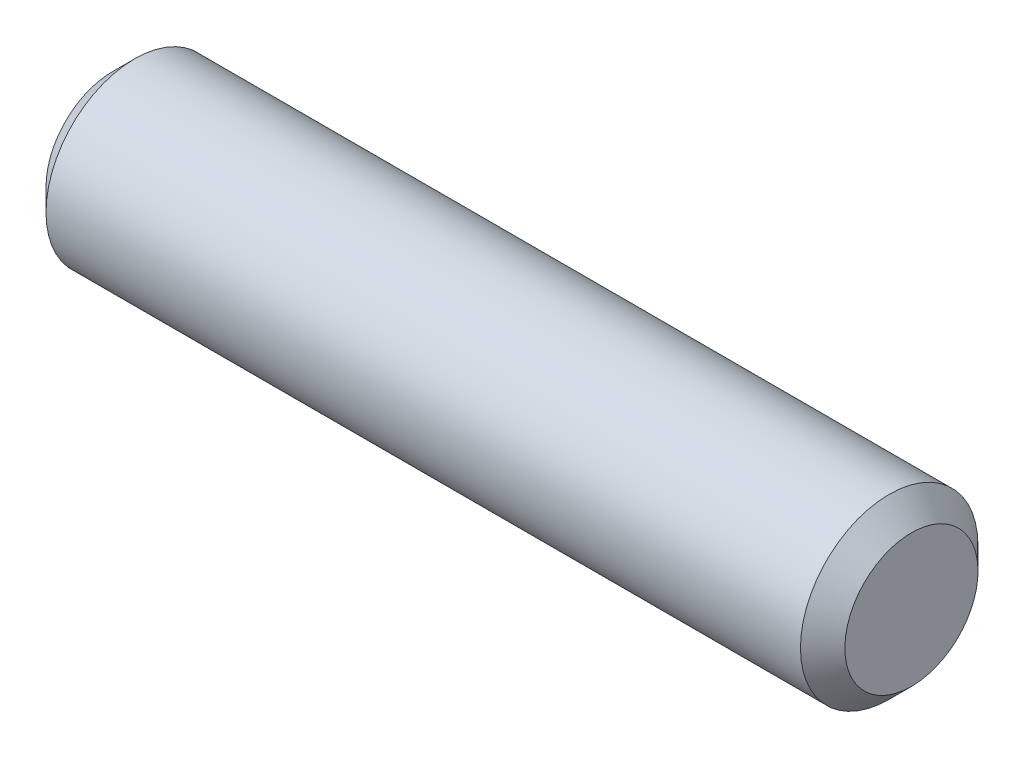
ISO-10303-21;
HEADER;
FILE_DESCRIPTION(('STEP AP214'),'2;1');
FILE_NAME('part.step','',(''),(''),'','','');
FILE_SCHEMA(('AUTOMOTIVE_DESIGN { 1 0 10303 214 1 1 1 1 }'));
ENDSEC;
DATA;
#1=APPLICATION_CONTEXT('core data for automotive mechanical design processes');
#2=APPLICATION_PROTOCOL_DEFINITION('international standard','automotive_design',2000,#1);
#3=PRODUCT_CONTEXT('',#1,'mechanical');
#4=PRODUCT('Part','Part','',(#3));
#5=PRODUCT_RELATED_PRODUCT_CATEGORY('part','',(#4));
#6=PRODUCT_DEFINITION_FORMATION('','',#4);
#7=PRODUCT_DEFINITION_CONTEXT('part definition',#1,'design');
#8=PRODUCT_DEFINITION('design','',#6,#7);
#9=PRODUCT_DEFINITION_SHAPE('','',#8);
#10=(LENGTH_UNIT() NAMED_UNIT(*) SI_UNIT(.MILLI.,.METRE.));
#11=(NAMED_UNIT(*) PLANE_ANGLE_UNIT() SI_UNIT($,.RADIAN.));
#12=(NAMED_UNIT(*) SI_UNIT($,.STERADIAN.) SOLID_ANGLE_UNIT());
#13=UNCERTAINTY_MEASURE_WITH_UNIT(LENGTH_MEASURE(1.E-05),#10,'distance_accuracy_value','');
#14=(GEOMETRIC_REPRESENTATION_CONTEXT(3) GLOBAL_UNCERTAINTY_ASSIGNED_CONTEXT((#13)) GLOBAL_UNIT_ASSIGNED_CONTEXT((#10,
#11,#12)) REPRESENTATION_CONTEXT('',''));
#15=CARTESIAN_POINT('',(0.,0.,0.));
#16=DIRECTION('',(0.,0.,1.));
#17=DIRECTION('',(1.,0.,0.));
#18=AXIS2_PLACEMENT_3D('',#15,#16,#17);
#19=CARTESIAN_POINT('',(14.2875,0.,0.));
#20=DIRECTION('',(1.,0.,0.));
#21=DIRECTION('',(0.,0.,1.));
#22=AXIS2_PLACEMENT_3D('',#19,#20,#21);
#23=PLANE('',#22);
#24=CARTESIAN_POINT('',(14.2875000000231,0.,0.));
#25=DIRECTION('',(1.,0.,0.));
#26=DIRECTION('',(0.,-1.,0.));
#27=AXIS2_PLACEMENT_3D('',#24,#25,#26);
#28=CIRCLE('',#27,2.3812499999849);
#29=CARTESIAN_POINT('',(14.2875000000231,-2.3812499999849,0.));
#30=VERTEX_POINT('',#29);
#31=EDGE_CURVE('E38',#30,#30,#28,.T.);
#32=ORIENTED_EDGE('',*,*,#31,.T.);
#33=EDGE_LOOP('',(#32));
#34=FACE_BOUND('',#33,.T.);
#35=ADVANCED_FACE('F35',(#34),#23,.T.);
#36=CARTESIAN_POINT('',(-14.2875,0.,0.));
#37=DIRECTION('',(1.,0.,0.));
#38=DIRECTION('',(0.,0.,1.));
#39=AXIS2_PLACEMENT_3D('',#36,#37,#38);
#40=PLANE('',#39);
#41=CARTESIAN_POINT('',(-14.2874999999663,0.,0.));
#42=DIRECTION('',(-1.,0.,0.));
#43=DIRECTION('',(0.,0.,1.));
#44=AXIS2_PLACEMENT_3D('',#41,#42,#43);
#45=CIRCLE('',#44,2.38125000004175);
#46=CARTESIAN_POINT('',(-14.2874999999663,0.,2.38125000004175));
#47=VERTEX_POINT('',#46);
#48=EDGE_CURVE('E47',#47,#47,#45,.T.);
#49=ORIENTED_EDGE('',*,*,#48,.T.);
#50=EDGE_LOOP('',(#49));
#51=FACE_BOUND('',#50,.T.);
#52=ADVANCED_FACE('F59',(#51),#40,.F.);
#53=CARTESIAN_POINT('',(13.493750000066,0.,0.));
#54=DIRECTION('',(-1.,0.,0.));
#55=DIRECTION('',(0.,-1.,0.));
#56=AXIS2_PLACEMENT_3D('',#53,#54,#55);
#57=CONICAL_SURFACE('',#56,3.17499999994197,0.785398163397448);
#58=CARTESIAN_POINT('',(13.49375,0.,0.));
#59=DIRECTION('',(1.,0.,0.));
#60=DIRECTION('',(0.,0.,-1.));
#61=AXIS2_PLACEMENT_3D('',#58,#59,#60);
#62=CIRCLE('',#61,3.175);
#63=CARTESIAN_POINT('',(13.49375,0.,-3.175));
#64=VERTEX_POINT('',#63);
#65=EDGE_CURVE('E42',#64,#64,#62,.T.);
#66=ORIENTED_EDGE('',*,*,#65,.T.);
#67=EDGE_LOOP('',(#66));
#68=FACE_BOUND('',#67,.T.);
#69=ORIENTED_EDGE('',*,*,#31,.F.);
#70=EDGE_LOOP('',(#69));
#71=FACE_BOUND('',#70,.T.);
#72=ADVANCED_FACE('F56',(#68,#71),#57,.T.);
#73=CARTESIAN_POINT('',(-13.4937500000092,0.,0.));
#74=DIRECTION('',(1.,0.,0.));
#75=DIRECTION('',(0.,0.,1.));
#76=AXIS2_PLACEMENT_3D('',#73,#74,#75);
#77=CONICAL_SURFACE('',#76,3.17499999994197,0.785398163361641);
#78=CARTESIAN_POINT('',(-13.49375,0.,0.));
#79=DIRECTION('',(1.,0.,0.));
#80=DIRECTION('',(0.,0.,-1.));
#81=AXIS2_PLACEMENT_3D('',#78,#79,#80);
#82=CIRCLE('',#81,3.175);
#83=CARTESIAN_POINT('',(-13.49375,0.,-3.175));
#84=VERTEX_POINT('',#83);
#85=EDGE_CURVE('E10',#84,#84,#82,.F.);
#86=ORIENTED_EDGE('',*,*,#85,.T.);
#87=EDGE_LOOP('',(#86));
#88=FACE_BOUND('',#87,.T.);
#89=ORIENTED_EDGE('',*,*,#48,.F.);
#90=EDGE_LOOP('',(#89));
#91=FACE_BOUND('',#90,.T.);
#92=ADVANCED_FACE('F58',(#88,#91),#77,.T.);
#93=CARTESIAN_POINT('',(14.2875,0.,0.));
#94=DIRECTION('',(-1.,0.,0.));
#95=DIRECTION('',(0.,0.,-1.));
#96=AXIS2_PLACEMENT_3D('',#93,#94,#95);
#97=CYLINDRICAL_SURFACE('',#96,3.175);
#98=ORIENTED_EDGE('',*,*,#85,.F.);
#99=EDGE_LOOP('',(#98));
#100=FACE_BOUND('',#99,.T.);
#101=ORIENTED_EDGE('',*,*,#65,.F.);
#102=EDGE_LOOP('',(#101));
#103=FACE_BOUND('',#102,.T.);
#104=ADVANCED_FACE('F66',(#100,#103),#97,.T.);
#105=CLOSED_SHELL('',(#35,#52,#72,#92,#104));
#106=MANIFOLD_SOLID_BREP('B2',#105);
#107=ADVANCED_BREP_SHAPE_REPRESENTATION('',(#18,#106),#14);
#108=SHAPE_DEFINITION_REPRESENTATION(#9,#107);
ENDSEC;
END-ISO-10303-21;
